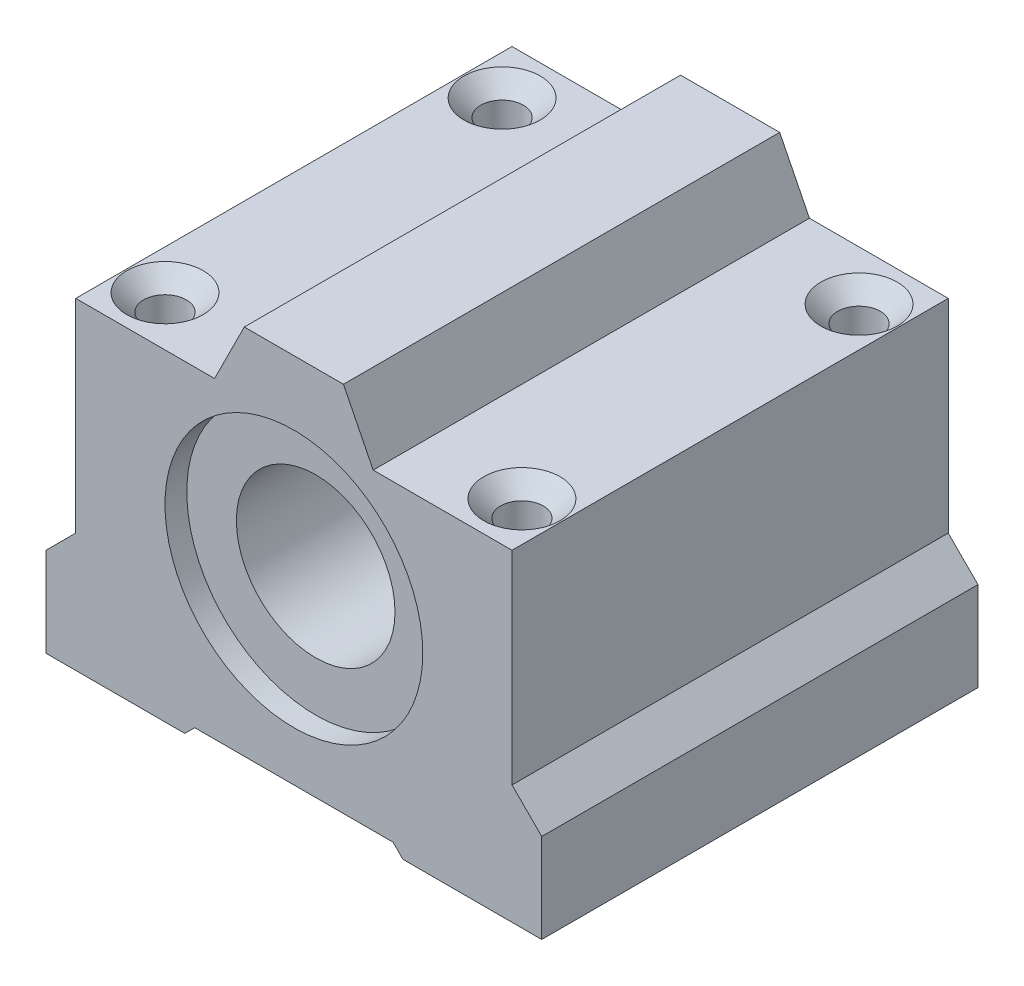
ISO-10303-21;
HEADER;
FILE_DESCRIPTION(('STEP AP214'),'2;1');
FILE_NAME('part.step','',(''),(''),'','','');
FILE_SCHEMA(('AUTOMOTIVE_DESIGN { 1 0 10303 214 1 1 1 1 }'));
ENDSEC;
DATA;
#1=APPLICATION_CONTEXT('core data for automotive mechanical design processes');
#2=APPLICATION_PROTOCOL_DEFINITION('international standard','automotive_design',2000,#1);
#3=PRODUCT_CONTEXT('',#1,'mechanical');
#4=PRODUCT('Part','Part','',(#3));
#5=PRODUCT_RELATED_PRODUCT_CATEGORY('part','',(#4));
#6=PRODUCT_DEFINITION_FORMATION('','',#4);
#7=PRODUCT_DEFINITION_CONTEXT('part definition',#1,'design');
#8=PRODUCT_DEFINITION('design','',#6,#7);
#9=PRODUCT_DEFINITION_SHAPE('','',#8);
#10=(LENGTH_UNIT() NAMED_UNIT(*) SI_UNIT(.MILLI.,.METRE.));
#11=(NAMED_UNIT(*) PLANE_ANGLE_UNIT() SI_UNIT($,.RADIAN.));
#12=(NAMED_UNIT(*) SI_UNIT($,.STERADIAN.) SOLID_ANGLE_UNIT());
#13=UNCERTAINTY_MEASURE_WITH_UNIT(LENGTH_MEASURE(1.E-05),#10,'distance_accuracy_value','');
#14=(GEOMETRIC_REPRESENTATION_CONTEXT(3) GLOBAL_UNCERTAINTY_ASSIGNED_CONTEXT((#13)) GLOBAL_UNIT_ASSIGNED_CONTEXT((#10,
#11,#12)) REPRESENTATION_CONTEXT('',''));
#15=CARTESIAN_POINT('',(0.,0.,0.));
#16=DIRECTION('',(0.,0.,1.));
#17=DIRECTION('',(1.,0.,0.));
#18=AXIS2_PLACEMENT_3D('',#15,#16,#17);
#19=CARTESIAN_POINT('',(-25.,-19.,44.));
#20=DIRECTION('',(0.,1.,0.));
#21=DIRECTION('',(-1.,0.,0.));
#22=AXIS2_PLACEMENT_3D('',#19,#20,#21);
#23=PLANE('',#22);
#24=CARTESIAN_POINT('',(-18.,-19.,39.));
#25=DIRECTION('',(0.,-1.,0.));
#26=DIRECTION('',(0.,0.,-1.));
#27=AXIS2_PLACEMENT_3D('',#24,#25,#26);
#28=CIRCLE('',#27,4.5);
#29=CARTESIAN_POINT('',(-18.,-19.,34.5));
#30=VERTEX_POINT('',#29);
#31=EDGE_CURVE('E851',#30,#30,#28,.T.);
#32=ORIENTED_EDGE('',*,*,#31,.F.);
#33=EDGE_LOOP('',(#32));
#34=FACE_BOUND('',#33,.T.);
#35=DIRECTION('',(1.,0.,0.));
#36=VECTOR('',#35,1.);
#37=CARTESIAN_POINT('',(-25.,-19.,0.));
#38=LINE('',#37,#36);
#39=CARTESIAN_POINT('',(-25.,-19.,0.));
#40=VERTEX_POINT('',#39);
#41=CARTESIAN_POINT('',(-11.,-19.,0.));
#42=VERTEX_POINT('',#41);
#43=EDGE_CURVE('E188',#40,#42,#38,.T.);
#44=ORIENTED_EDGE('',*,*,#43,.T.);
#45=DIRECTION('',(0.,0.,-1.));
#46=VECTOR('',#45,1.);
#47=CARTESIAN_POINT('',(-11.,-19.,44.));
#48=LINE('',#47,#46);
#49=CARTESIAN_POINT('',(-11.,-19.,44.));
#50=VERTEX_POINT('',#49);
#51=EDGE_CURVE('E234',#50,#42,#48,.T.);
#52=ORIENTED_EDGE('',*,*,#51,.F.);
#53=DIRECTION('',(1.,0.,0.));
#54=VECTOR('',#53,1.);
#55=CARTESIAN_POINT('',(-25.,-19.,44.));
#56=LINE('',#55,#54);
#57=CARTESIAN_POINT('',(-25.,-19.,44.));
#58=VERTEX_POINT('',#57);
#59=EDGE_CURVE('E505',#58,#50,#56,.T.);
#60=ORIENTED_EDGE('',*,*,#59,.F.);
#61=DIRECTION('',(0.,0.,-1.));
#62=VECTOR('',#61,1.);
#63=CARTESIAN_POINT('',(-25.,-19.,44.));
#64=LINE('',#63,#62);
#65=EDGE_CURVE('E237',#58,#40,#64,.T.);
#66=ORIENTED_EDGE('',*,*,#65,.T.);
#67=EDGE_LOOP('',(#44,#52,#60,#66));
#68=FACE_BOUND('',#67,.T.);
#69=CARTESIAN_POINT('',(-18.,-19.,5.));
#70=DIRECTION('',(0.,-1.,0.));
#71=DIRECTION('',(0.,0.,-1.));
#72=AXIS2_PLACEMENT_3D('',#69,#70,#71);
#73=CIRCLE('',#72,4.5);
#74=CARTESIAN_POINT('',(-18.,-19.,0.499999999999997));
#75=VERTEX_POINT('',#74);
#76=EDGE_CURVE('E275',#75,#75,#73,.T.);
#77=ORIENTED_EDGE('',*,*,#76,.F.);
#78=EDGE_LOOP('',(#77));
#79=FACE_BOUND('',#78,.T.);
#80=ADVANCED_FACE('F32',(#34,#68,#79),#23,.F.);
#81=CARTESIAN_POINT('',(11.,-19.,44.));
#82=DIRECTION('',(0.,1.,0.));
#83=DIRECTION('',(-1.,0.,0.));
#84=AXIS2_PLACEMENT_3D('',#81,#82,#83);
#85=PLANE('',#84);
#86=CARTESIAN_POINT('',(18.,-19.,39.));
#87=DIRECTION('',(0.,-1.,0.));
#88=DIRECTION('',(0.,0.,-1.));
#89=AXIS2_PLACEMENT_3D('',#86,#87,#88);
#90=CIRCLE('',#89,4.5);
#91=CARTESIAN_POINT('',(18.,-19.,34.5));
#92=VERTEX_POINT('',#91);
#93=EDGE_CURVE('E265',#92,#92,#90,.T.);
#94=ORIENTED_EDGE('',*,*,#93,.F.);
#95=EDGE_LOOP('',(#94));
#96=FACE_BOUND('',#95,.T.);
#97=DIRECTION('',(1.,0.,0.));
#98=VECTOR('',#97,1.);
#99=CARTESIAN_POINT('',(11.,-19.,0.));
#100=LINE('',#99,#98);
#101=CARTESIAN_POINT('',(11.,-19.,0.));
#102=VERTEX_POINT('',#101);
#103=CARTESIAN_POINT('',(25.,-19.,0.));
#104=VERTEX_POINT('',#103);
#105=EDGE_CURVE('E196',#102,#104,#100,.T.);
#106=ORIENTED_EDGE('',*,*,#105,.T.);
#107=DIRECTION('',(0.,0.,-1.));
#108=VECTOR('',#107,1.);
#109=CARTESIAN_POINT('',(25.,-19.,44.));
#110=LINE('',#109,#108);
#111=CARTESIAN_POINT('',(25.,-19.,44.));
#112=VERTEX_POINT('',#111);
#113=EDGE_CURVE('E222',#112,#104,#110,.T.);
#114=ORIENTED_EDGE('',*,*,#113,.F.);
#115=DIRECTION('',(1.,0.,0.));
#116=VECTOR('',#115,1.);
#117=CARTESIAN_POINT('',(11.,-19.,44.));
#118=LINE('',#117,#116);
#119=CARTESIAN_POINT('',(11.,-19.,44.));
#120=VERTEX_POINT('',#119);
#121=EDGE_CURVE('E479',#120,#112,#118,.T.);
#122=ORIENTED_EDGE('',*,*,#121,.F.);
#123=DIRECTION('',(0.,0.,-1.));
#124=VECTOR('',#123,1.);
#125=CARTESIAN_POINT('',(11.,-19.,44.));
#126=LINE('',#125,#124);
#127=EDGE_CURVE('E225',#120,#102,#126,.T.);
#128=ORIENTED_EDGE('',*,*,#127,.T.);
#129=EDGE_LOOP('',(#106,#114,#122,#128));
#130=FACE_BOUND('',#129,.T.);
#131=CARTESIAN_POINT('',(18.,-19.,5.));
#132=DIRECTION('',(0.,-1.,0.));
#133=DIRECTION('',(0.,0.,-1.));
#134=AXIS2_PLACEMENT_3D('',#131,#132,#133);
#135=CIRCLE('',#134,4.5);
#136=CARTESIAN_POINT('',(18.,-19.,0.5));
#137=VERTEX_POINT('',#136);
#138=EDGE_CURVE('E270',#137,#137,#135,.T.);
#139=ORIENTED_EDGE('',*,*,#138,.F.);
#140=EDGE_LOOP('',(#139));
#141=FACE_BOUND('',#140,.T.);
#142=ADVANCED_FACE('F331',(#96,#130,#141),#85,.F.);
#143=CARTESIAN_POINT('',(0.,0.,44.));
#144=DIRECTION('',(0.,0.,-1.));
#145=DIRECTION('',(-1.,0.,0.));
#146=AXIS2_PLACEMENT_3D('',#143,#144,#145);
#147=CYLINDRICAL_SURFACE('',#146,8.);
#148=CARTESIAN_POINT('',(0.,0.,41.8));
#149=DIRECTION('',(0.,0.,1.));
#150=DIRECTION('',(1.,0.,0.));
#151=AXIS2_PLACEMENT_3D('',#148,#149,#150);
#152=CIRCLE('',#151,8.);
#153=CARTESIAN_POINT('',(8.,0.,41.8));
#154=VERTEX_POINT('',#153);
#155=EDGE_CURVE('E182',#154,#154,#152,.T.);
#156=ORIENTED_EDGE('',*,*,#155,.T.);
#157=EDGE_LOOP('',(#156));
#158=FACE_BOUND('',#157,.T.);
#159=CARTESIAN_POINT('',(0.,0.,2.2));
#160=DIRECTION('',(0.,0.,-1.));
#161=DIRECTION('',(-1.,0.,0.));
#162=AXIS2_PLACEMENT_3D('',#159,#160,#161);
#163=CIRCLE('',#162,8.);
#164=CARTESIAN_POINT('',(-8.,0.,2.2));
#165=VERTEX_POINT('',#164);
#166=EDGE_CURVE('E252',#165,#165,#163,.T.);
#167=ORIENTED_EDGE('',*,*,#166,.T.);
#168=EDGE_LOOP('',(#167));
#169=FACE_BOUND('',#168,.T.);
#170=ADVANCED_FACE('F337',(#158,#169),#147,.F.);
#171=CARTESIAN_POINT('',(-22.,13.5,44.));
#172=DIRECTION('',(0.,0.,1.));
#173=DIRECTION('',(1.,0.,0.));
#174=AXIS2_PLACEMENT_3D('',#171,#172,#173);
#175=PLANE('',#174);
#176=CARTESIAN_POINT('',(0.,0.,44.));
#177=DIRECTION('',(0.,0.,1.));
#178=DIRECTION('',(1.,0.,0.));
#179=AXIS2_PLACEMENT_3D('',#176,#177,#178);
#180=CIRCLE('',#179,13.);
#181=CARTESIAN_POINT('',(13.,0.,44.));
#182=VERTEX_POINT('',#181);
#183=EDGE_CURVE('E255',#182,#182,#180,.T.);
#184=ORIENTED_EDGE('',*,*,#183,.F.);
#185=EDGE_LOOP('',(#184));
#186=FACE_BOUND('',#185,.T.);
#187=DIRECTION('',(-1.,0.,0.));
#188=VECTOR('',#187,1.);
#189=CARTESIAN_POINT('',(-8.,13.5,44.));
#190=LINE('',#189,#188);
#191=CARTESIAN_POINT('',(-8.,13.5,44.));
#192=VERTEX_POINT('',#191);
#193=CARTESIAN_POINT('',(-22.,13.5,44.));
#194=VERTEX_POINT('',#193);
#195=EDGE_CURVE('E209',#192,#194,#190,.T.);
#196=ORIENTED_EDGE('',*,*,#195,.T.);
#197=DIRECTION('',(0.,-1.,0.));
#198=VECTOR('',#197,1.);
#199=CARTESIAN_POINT('',(-22.,13.5,44.));
#200=LINE('',#199,#198);
#201=CARTESIAN_POINT('',(-22.,-7.,44.));
#202=VERTEX_POINT('',#201);
#203=EDGE_CURVE('E117',#194,#202,#200,.T.);
#204=ORIENTED_EDGE('',*,*,#203,.T.);
#205=DIRECTION('',(-0.707106781186547,-0.707106781186548,0.));
#206=VECTOR('',#205,1.);
#207=CARTESIAN_POINT('',(-22.,-7.,44.));
#208=LINE('',#207,#206);
#209=CARTESIAN_POINT('',(-25.,-10.,44.));
#210=VERTEX_POINT('',#209);
#211=EDGE_CURVE('E497',#202,#210,#208,.T.);
#212=ORIENTED_EDGE('',*,*,#211,.T.);
#213=DIRECTION('',(0.,-1.,0.));
#214=VECTOR('',#213,1.);
#215=CARTESIAN_POINT('',(-25.,-10.,44.));
#216=LINE('',#215,#214);
#217=EDGE_CURVE('E503',#210,#58,#216,.T.);
#218=ORIENTED_EDGE('',*,*,#217,.T.);
#219=ORIENTED_EDGE('',*,*,#59,.T.);
#220=DIRECTION('',(0.707106781186546,0.707106781186549,0.));
#221=VECTOR('',#220,1.);
#222=CARTESIAN_POINT('',(-11.,-19.,44.));
#223=LINE('',#222,#221);
#224=CARTESIAN_POINT('',(-10.,-18.,44.));
#225=VERTEX_POINT('',#224);
#226=EDGE_CURVE('E507',#50,#225,#223,.T.);
#227=ORIENTED_EDGE('',*,*,#226,.T.);
#228=DIRECTION('',(1.,0.,0.));
#229=VECTOR('',#228,1.);
#230=CARTESIAN_POINT('',(-10.,-18.,44.));
#231=LINE('',#230,#229);
#232=CARTESIAN_POINT('',(10.,-18.,44.));
#233=VERTEX_POINT('',#232);
#234=EDGE_CURVE('E509',#225,#233,#231,.T.);
#235=ORIENTED_EDGE('',*,*,#234,.T.);
#236=DIRECTION('',(0.707106781186547,-0.707106781186548,0.));
#237=VECTOR('',#236,1.);
#238=CARTESIAN_POINT('',(10.,-18.,44.));
#239=LINE('',#238,#237);
#240=EDGE_CURVE('E465',#233,#120,#239,.T.);
#241=ORIENTED_EDGE('',*,*,#240,.T.);
#242=ORIENTED_EDGE('',*,*,#121,.T.);
#243=DIRECTION('',(0.,1.,0.));
#244=VECTOR('',#243,1.);
#245=CARTESIAN_POINT('',(25.,-19.,44.));
#246=LINE('',#245,#244);
#247=CARTESIAN_POINT('',(25.,-10.,44.));
#248=VERTEX_POINT('',#247);
#249=EDGE_CURVE('E476',#112,#248,#246,.T.);
#250=ORIENTED_EDGE('',*,*,#249,.T.);
#251=DIRECTION('',(-0.70710678118655,0.707106781186545,0.));
#252=VECTOR('',#251,1.);
#253=CARTESIAN_POINT('',(25.,-10.,44.));
#254=LINE('',#253,#252);
#255=CARTESIAN_POINT('',(22.,-7.,44.));
#256=VERTEX_POINT('',#255);
#257=EDGE_CURVE('E478',#248,#256,#254,.T.);
#258=ORIENTED_EDGE('',*,*,#257,.T.);
#259=DIRECTION('',(0.,1.,0.));
#260=VECTOR('',#259,1.);
#261=CARTESIAN_POINT('',(22.,-7.,44.));
#262=LINE('',#261,#260);
#263=CARTESIAN_POINT('',(22.,13.5,44.));
#264=VERTEX_POINT('',#263);
#265=EDGE_CURVE('E481',#256,#264,#262,.T.);
#266=ORIENTED_EDGE('',*,*,#265,.T.);
#267=DIRECTION('',(-1.,0.,0.));
#268=VECTOR('',#267,1.);
#269=CARTESIAN_POINT('',(22.,13.5,44.));
#270=LINE('',#269,#268);
#271=CARTESIAN_POINT('',(8.,13.5,44.));
#272=VERTEX_POINT('',#271);
#273=EDGE_CURVE('E160',#264,#272,#270,.T.);
#274=ORIENTED_EDGE('',*,*,#273,.T.);
#275=DIRECTION('',(-0.447213595499958,0.894427190999916,0.));
#276=VECTOR('',#275,1.);
#277=CARTESIAN_POINT('',(8.,13.5,44.));
#278=LINE('',#277,#276);
#279=CARTESIAN_POINT('',(5.,19.5,44.));
#280=VERTEX_POINT('',#279);
#281=EDGE_CURVE('E154',#272,#280,#278,.T.);
#282=ORIENTED_EDGE('',*,*,#281,.T.);
#283=DIRECTION('',(-1.,0.,0.));
#284=VECTOR('',#283,1.);
#285=CARTESIAN_POINT('',(5.,19.5,44.));
#286=LINE('',#285,#284);
#287=CARTESIAN_POINT('',(-5.,19.5,44.));
#288=VERTEX_POINT('',#287);
#289=EDGE_CURVE('E158',#280,#288,#286,.T.);
#290=ORIENTED_EDGE('',*,*,#289,.T.);
#291=DIRECTION('',(-0.447213595499958,-0.894427190999916,0.));
#292=VECTOR('',#291,1.);
#293=CARTESIAN_POINT('',(-5.,19.5,44.));
#294=LINE('',#293,#292);
#295=EDGE_CURVE('E49',#288,#192,#294,.T.);
#296=ORIENTED_EDGE('',*,*,#295,.T.);
#297=EDGE_LOOP('',(#196,#204,#212,#218,#219,#227,#235,#241,#242,#250,#258,#266,#274,#282,#290,#296));
#298=FACE_BOUND('',#297,.T.);
#299=ADVANCED_FACE('F156',(#186,#298),#175,.T.);
#300=CARTESIAN_POINT('',(-22.,13.5,0.));
#301=DIRECTION('',(0.,0.,1.));
#302=DIRECTION('',(1.,0.,0.));
#303=AXIS2_PLACEMENT_3D('',#300,#301,#302);
#304=PLANE('',#303);
#305=CARTESIAN_POINT('',(0.,0.,0.));
#306=DIRECTION('',(0.,0.,-1.));
#307=DIRECTION('',(-1.,0.,0.));
#308=AXIS2_PLACEMENT_3D('',#305,#306,#307);
#309=CIRCLE('',#308,13.);
#310=CARTESIAN_POINT('',(-13.,0.,0.));
#311=VERTEX_POINT('',#310);
#312=EDGE_CURVE('E260',#311,#311,#309,.T.);
#313=ORIENTED_EDGE('',*,*,#312,.F.);
#314=EDGE_LOOP('',(#313));
#315=FACE_BOUND('',#314,.T.);
#316=DIRECTION('',(-1.,0.,0.));
#317=VECTOR('',#316,1.);
#318=CARTESIAN_POINT('',(-8.,13.5,0.));
#319=LINE('',#318,#317);
#320=CARTESIAN_POINT('',(-8.,13.5,0.));
#321=VERTEX_POINT('',#320);
#322=CARTESIAN_POINT('',(-22.,13.5,0.));
#323=VERTEX_POINT('',#322);
#324=EDGE_CURVE('E178',#321,#323,#319,.T.);
#325=ORIENTED_EDGE('',*,*,#324,.F.);
#326=DIRECTION('',(-0.447213595499958,-0.894427190999916,0.));
#327=VECTOR('',#326,1.);
#328=CARTESIAN_POINT('',(-5.,19.5,0.));
#329=LINE('',#328,#327);
#330=CARTESIAN_POINT('',(-5.,19.5,0.));
#331=VERTEX_POINT('',#330);
#332=EDGE_CURVE('E108',#331,#321,#329,.T.);
#333=ORIENTED_EDGE('',*,*,#332,.F.);
#334=DIRECTION('',(-1.,0.,0.));
#335=VECTOR('',#334,1.);
#336=CARTESIAN_POINT('',(5.,19.5,0.));
#337=LINE('',#336,#335);
#338=CARTESIAN_POINT('',(5.,19.5,0.));
#339=VERTEX_POINT('',#338);
#340=EDGE_CURVE('E102',#339,#331,#337,.T.);
#341=ORIENTED_EDGE('',*,*,#340,.F.);
#342=DIRECTION('',(-0.447213595499958,0.894427190999916,0.));
#343=VECTOR('',#342,1.);
#344=CARTESIAN_POINT('',(8.,13.5,0.));
#345=LINE('',#344,#343);
#346=CARTESIAN_POINT('',(8.,13.5,0.));
#347=VERTEX_POINT('',#346);
#348=EDGE_CURVE('E168',#347,#339,#345,.T.);
#349=ORIENTED_EDGE('',*,*,#348,.F.);
#350=DIRECTION('',(-1.,0.,0.));
#351=VECTOR('',#350,1.);
#352=CARTESIAN_POINT('',(22.,13.5,0.));
#353=LINE('',#352,#351);
#354=CARTESIAN_POINT('',(22.,13.5,0.));
#355=VERTEX_POINT('',#354);
#356=EDGE_CURVE('E204',#355,#347,#353,.T.);
#357=ORIENTED_EDGE('',*,*,#356,.F.);
#358=DIRECTION('',(0.,1.,0.));
#359=VECTOR('',#358,1.);
#360=CARTESIAN_POINT('',(22.,-7.,0.));
#361=LINE('',#360,#359);
#362=CARTESIAN_POINT('',(22.,-7.,0.));
#363=VERTEX_POINT('',#362);
#364=EDGE_CURVE('E202',#363,#355,#361,.T.);
#365=ORIENTED_EDGE('',*,*,#364,.F.);
#366=DIRECTION('',(-0.70710678118655,0.707106781186545,0.));
#367=VECTOR('',#366,1.);
#368=CARTESIAN_POINT('',(25.,-10.,0.));
#369=LINE('',#368,#367);
#370=CARTESIAN_POINT('',(25.,-10.,0.));
#371=VERTEX_POINT('',#370);
#372=EDGE_CURVE('E200',#371,#363,#369,.T.);
#373=ORIENTED_EDGE('',*,*,#372,.F.);
#374=DIRECTION('',(0.,1.,0.));
#375=VECTOR('',#374,1.);
#376=CARTESIAN_POINT('',(25.,-19.,0.));
#377=LINE('',#376,#375);
#378=EDGE_CURVE('E198',#104,#371,#377,.T.);
#379=ORIENTED_EDGE('',*,*,#378,.F.);
#380=ORIENTED_EDGE('',*,*,#105,.F.);
#381=DIRECTION('',(0.707106781186547,-0.707106781186548,0.));
#382=VECTOR('',#381,1.);
#383=CARTESIAN_POINT('',(10.,-18.,0.));
#384=LINE('',#383,#382);
#385=CARTESIAN_POINT('',(10.,-18.,0.));
#386=VERTEX_POINT('',#385);
#387=EDGE_CURVE('E194',#386,#102,#384,.T.);
#388=ORIENTED_EDGE('',*,*,#387,.F.);
#389=DIRECTION('',(1.,0.,0.));
#390=VECTOR('',#389,1.);
#391=CARTESIAN_POINT('',(-10.,-18.,0.));
#392=LINE('',#391,#390);
#393=CARTESIAN_POINT('',(-10.,-18.,0.));
#394=VERTEX_POINT('',#393);
#395=EDGE_CURVE('E192',#394,#386,#392,.T.);
#396=ORIENTED_EDGE('',*,*,#395,.F.);
#397=DIRECTION('',(0.707106781186546,0.707106781186549,0.));
#398=VECTOR('',#397,1.);
#399=CARTESIAN_POINT('',(-11.,-19.,0.));
#400=LINE('',#399,#398);
#401=EDGE_CURVE('E190',#42,#394,#400,.T.);
#402=ORIENTED_EDGE('',*,*,#401,.F.);
#403=ORIENTED_EDGE('',*,*,#43,.F.);
#404=DIRECTION('',(0.,-1.,0.));
#405=VECTOR('',#404,1.);
#406=CARTESIAN_POINT('',(-25.,-10.,0.));
#407=LINE('',#406,#405);
#408=CARTESIAN_POINT('',(-25.,-10.,0.));
#409=VERTEX_POINT('',#408);
#410=EDGE_CURVE('E186',#409,#40,#407,.T.);
#411=ORIENTED_EDGE('',*,*,#410,.F.);
#412=DIRECTION('',(-0.707106781186547,-0.707106781186548,0.));
#413=VECTOR('',#412,1.);
#414=CARTESIAN_POINT('',(-22.,-7.,0.));
#415=LINE('',#414,#413);
#416=CARTESIAN_POINT('',(-22.,-7.,0.));
#417=VERTEX_POINT('',#416);
#418=EDGE_CURVE('E184',#417,#409,#415,.T.);
#419=ORIENTED_EDGE('',*,*,#418,.F.);
#420=DIRECTION('',(0.,-1.,0.));
#421=VECTOR('',#420,1.);
#422=CARTESIAN_POINT('',(-22.,13.5,0.));
#423=LINE('',#422,#421);
#424=EDGE_CURVE('E181',#323,#417,#423,.T.);
#425=ORIENTED_EDGE('',*,*,#424,.F.);
#426=EDGE_LOOP('',(#325,#333,#341,#349,#357,#365,#373,#379,#380,#388,#396,#402,#403,#411,#419,#425));
#427=FACE_BOUND('',#426,.T.);
#428=ADVANCED_FACE('F359',(#315,#427),#304,.F.);
#429=CARTESIAN_POINT('',(-8.,13.5,44.));
#430=DIRECTION('',(0.,-1.,0.));
#431=DIRECTION('',(1.,0.,0.));
#432=AXIS2_PLACEMENT_3D('',#429,#430,#431);
#433=PLANE('',#432);
#434=CARTESIAN_POINT('',(-18.,13.5,39.));
#435=DIRECTION('',(0.,-1.,0.));
#436=DIRECTION('',(1.,0.,0.));
#437=AXIS2_PLACEMENT_3D('',#434,#435,#436);
#438=CIRCLE('',#437,3.85);
#439=CARTESIAN_POINT('',(-14.15,13.5,39.));
#440=VERTEX_POINT('',#439);
#441=EDGE_CURVE('E41',#440,#440,#438,.T.);
#442=ORIENTED_EDGE('',*,*,#441,.T.);
#443=EDGE_LOOP('',(#442));
#444=FACE_BOUND('',#443,.T.);
#445=CARTESIAN_POINT('',(-18.,13.5,5.));
#446=DIRECTION('',(0.,-1.,0.));
#447=DIRECTION('',(1.,0.,0.));
#448=AXIS2_PLACEMENT_3D('',#445,#446,#447);
#449=CIRCLE('',#448,3.85);
#450=CARTESIAN_POINT('',(-14.15,13.5,5.));
#451=VERTEX_POINT('',#450);
#452=EDGE_CURVE('E291',#451,#451,#449,.T.);
#453=ORIENTED_EDGE('',*,*,#452,.T.);
#454=EDGE_LOOP('',(#453));
#455=FACE_BOUND('',#454,.T.);
#456=ORIENTED_EDGE('',*,*,#324,.T.);
#457=DIRECTION('',(0.,0.,-1.));
#458=VECTOR('',#457,1.);
#459=CARTESIAN_POINT('',(-22.,13.5,44.));
#460=LINE('',#459,#458);
#461=EDGE_CURVE('E246',#194,#323,#460,.T.);
#462=ORIENTED_EDGE('',*,*,#461,.F.);
#463=ORIENTED_EDGE('',*,*,#195,.F.);
#464=DIRECTION('',(0.,0.,-1.));
#465=VECTOR('',#464,1.);
#466=CARTESIAN_POINT('',(-8.,13.5,44.));
#467=LINE('',#466,#465);
#468=EDGE_CURVE('E174',#192,#321,#467,.T.);
#469=ORIENTED_EDGE('',*,*,#468,.T.);
#470=EDGE_LOOP('',(#456,#462,#463,#469));
#471=FACE_BOUND('',#470,.T.);
#472=ADVANCED_FACE('F296',(#444,#455,#471),#433,.F.);
#473=CARTESIAN_POINT('',(-22.,13.5,44.));
#474=DIRECTION('',(1.,0.,0.));
#475=DIRECTION('',(0.,0.,-1.));
#476=AXIS2_PLACEMENT_3D('',#473,#474,#475);
#477=PLANE('',#476);
#478=ORIENTED_EDGE('',*,*,#424,.T.);
#479=DIRECTION('',(0.,0.,-1.));
#480=VECTOR('',#479,1.);
#481=CARTESIAN_POINT('',(-22.,-7.,44.));
#482=LINE('',#481,#480);
#483=EDGE_CURVE('E243',#202,#417,#482,.T.);
#484=ORIENTED_EDGE('',*,*,#483,.F.);
#485=ORIENTED_EDGE('',*,*,#203,.F.);
#486=ORIENTED_EDGE('',*,*,#461,.T.);
#487=EDGE_LOOP('',(#478,#484,#485,#486));
#488=FACE_BOUND('',#487,.T.);
#489=ADVANCED_FACE('F353',(#488),#477,.F.);
#490=CARTESIAN_POINT('',(-22.,-7.,44.));
#491=DIRECTION('',(0.707106781186548,-0.707106781186547,0.));
#492=DIRECTION('',(0.707106781186547,0.707106781186548,0.));
#493=AXIS2_PLACEMENT_3D('',#490,#491,#492);
#494=PLANE('',#493);
#495=ORIENTED_EDGE('',*,*,#418,.T.);
#496=DIRECTION('',(0.,0.,-1.));
#497=VECTOR('',#496,1.);
#498=CARTESIAN_POINT('',(-25.,-10.,44.));
#499=LINE('',#498,#497);
#500=EDGE_CURVE('E240',#210,#409,#499,.T.);
#501=ORIENTED_EDGE('',*,*,#500,.F.);
#502=ORIENTED_EDGE('',*,*,#211,.F.);
#503=ORIENTED_EDGE('',*,*,#483,.T.);
#504=EDGE_LOOP('',(#495,#501,#502,#503));
#505=FACE_BOUND('',#504,.T.);
#506=ADVANCED_FACE('F349',(#505),#494,.F.);
#507=CARTESIAN_POINT('',(-25.,-10.,44.));
#508=DIRECTION('',(1.,0.,0.));
#509=DIRECTION('',(0.,0.,-1.));
#510=AXIS2_PLACEMENT_3D('',#507,#508,#509);
#511=PLANE('',#510);
#512=ORIENTED_EDGE('',*,*,#410,.T.);
#513=ORIENTED_EDGE('',*,*,#65,.F.);
#514=ORIENTED_EDGE('',*,*,#217,.F.);
#515=ORIENTED_EDGE('',*,*,#500,.T.);
#516=EDGE_LOOP('',(#512,#513,#514,#515));
#517=FACE_BOUND('',#516,.T.);
#518=ADVANCED_FACE('F346',(#517),#511,.F.);
#519=CARTESIAN_POINT('',(-11.,-19.,44.));
#520=DIRECTION('',(-0.707106781186549,0.707106781186546,0.));
#521=DIRECTION('',(-0.707106781186546,-0.707106781186549,0.));
#522=AXIS2_PLACEMENT_3D('',#519,#520,#521);
#523=PLANE('',#522);
#524=ORIENTED_EDGE('',*,*,#401,.T.);
#525=DIRECTION('',(0.,0.,-1.));
#526=VECTOR('',#525,1.);
#527=CARTESIAN_POINT('',(-10.,-18.,44.));
#528=LINE('',#527,#526);
#529=EDGE_CURVE('E231',#225,#394,#528,.T.);
#530=ORIENTED_EDGE('',*,*,#529,.F.);
#531=ORIENTED_EDGE('',*,*,#226,.F.);
#532=ORIENTED_EDGE('',*,*,#51,.T.);
#533=EDGE_LOOP('',(#524,#530,#531,#532));
#534=FACE_BOUND('',#533,.T.);
#535=ADVANCED_FACE('F344',(#534),#523,.F.);
#536=CARTESIAN_POINT('',(-10.,-18.,44.));
#537=DIRECTION('',(0.,1.,0.));
#538=DIRECTION('',(0.,0.,1.));
#539=AXIS2_PLACEMENT_3D('',#536,#537,#538);
#540=PLANE('',#539);
#541=ORIENTED_EDGE('',*,*,#395,.T.);
#542=DIRECTION('',(0.,0.,-1.));
#543=VECTOR('',#542,1.);
#544=CARTESIAN_POINT('',(10.,-18.,44.));
#545=LINE('',#544,#543);
#546=EDGE_CURVE('E228',#233,#386,#545,.T.);
#547=ORIENTED_EDGE('',*,*,#546,.F.);
#548=ORIENTED_EDGE('',*,*,#234,.F.);
#549=ORIENTED_EDGE('',*,*,#529,.T.);
#550=EDGE_LOOP('',(#541,#547,#548,#549));
#551=FACE_BOUND('',#550,.T.);
#552=ADVANCED_FACE('F448',(#551),#540,.F.);
#553=CARTESIAN_POINT('',(10.,-18.,44.));
#554=DIRECTION('',(0.707106781186548,0.707106781186547,0.));
#555=DIRECTION('',(-0.707106781186547,0.707106781186548,0.));
#556=AXIS2_PLACEMENT_3D('',#553,#554,#555);
#557=PLANE('',#556);
#558=ORIENTED_EDGE('',*,*,#387,.T.);
#559=ORIENTED_EDGE('',*,*,#127,.F.);
#560=ORIENTED_EDGE('',*,*,#240,.F.);
#561=ORIENTED_EDGE('',*,*,#546,.T.);
#562=EDGE_LOOP('',(#558,#559,#560,#561));
#563=FACE_BOUND('',#562,.T.);
#564=ADVANCED_FACE('F444',(#563),#557,.F.);
#565=CARTESIAN_POINT('',(25.,-19.,44.));
#566=DIRECTION('',(-1.,0.,0.));
#567=DIRECTION('',(0.,0.,1.));
#568=AXIS2_PLACEMENT_3D('',#565,#566,#567);
#569=PLANE('',#568);
#570=ORIENTED_EDGE('',*,*,#378,.T.);
#571=DIRECTION('',(0.,0.,-1.));
#572=VECTOR('',#571,1.);
#573=CARTESIAN_POINT('',(25.,-10.,44.));
#574=LINE('',#573,#572);
#575=EDGE_CURVE('E219',#248,#371,#574,.T.);
#576=ORIENTED_EDGE('',*,*,#575,.F.);
#577=ORIENTED_EDGE('',*,*,#249,.F.);
#578=ORIENTED_EDGE('',*,*,#113,.T.);
#579=EDGE_LOOP('',(#570,#576,#577,#578));
#580=FACE_BOUND('',#579,.T.);
#581=ADVANCED_FACE('F441',(#580),#569,.F.);
#582=CARTESIAN_POINT('',(25.,-10.,44.));
#583=DIRECTION('',(-0.707106781186545,-0.70710678118655,0.));
#584=DIRECTION('',(0.70710678118655,-0.707106781186545,0.));
#585=AXIS2_PLACEMENT_3D('',#582,#583,#584);
#586=PLANE('',#585);
#587=ORIENTED_EDGE('',*,*,#372,.T.);
#588=DIRECTION('',(0.,0.,-1.));
#589=VECTOR('',#588,1.);
#590=CARTESIAN_POINT('',(22.,-7.,44.));
#591=LINE('',#590,#589);
#592=EDGE_CURVE('E216',#256,#363,#591,.T.);
#593=ORIENTED_EDGE('',*,*,#592,.F.);
#594=ORIENTED_EDGE('',*,*,#257,.F.);
#595=ORIENTED_EDGE('',*,*,#575,.T.);
#596=EDGE_LOOP('',(#587,#593,#594,#595));
#597=FACE_BOUND('',#596,.T.);
#598=ADVANCED_FACE('F437',(#597),#586,.F.);
#599=CARTESIAN_POINT('',(22.,-7.,44.));
#600=DIRECTION('',(-1.,0.,0.));
#601=DIRECTION('',(0.,0.,1.));
#602=AXIS2_PLACEMENT_3D('',#599,#600,#601);
#603=PLANE('',#602);
#604=ORIENTED_EDGE('',*,*,#364,.T.);
#605=DIRECTION('',(0.,0.,-1.));
#606=VECTOR('',#605,1.);
#607=CARTESIAN_POINT('',(22.,13.5,44.));
#608=LINE('',#607,#606);
#609=EDGE_CURVE('E213',#264,#355,#608,.T.);
#610=ORIENTED_EDGE('',*,*,#609,.F.);
#611=ORIENTED_EDGE('',*,*,#265,.F.);
#612=ORIENTED_EDGE('',*,*,#592,.T.);
#613=EDGE_LOOP('',(#604,#610,#611,#612));
#614=FACE_BOUND('',#613,.T.);
#615=ADVANCED_FACE('F433',(#614),#603,.F.);
#616=CARTESIAN_POINT('',(22.,13.5,44.));
#617=DIRECTION('',(0.,-1.,0.));
#618=DIRECTION('',(1.,0.,0.));
#619=AXIS2_PLACEMENT_3D('',#616,#617,#618);
#620=PLANE('',#619);
#621=CARTESIAN_POINT('',(18.,13.5,5.));
#622=DIRECTION('',(0.,-1.,0.));
#623=DIRECTION('',(1.,0.,0.));
#624=AXIS2_PLACEMENT_3D('',#621,#622,#623);
#625=CIRCLE('',#624,3.85000000000001);
#626=CARTESIAN_POINT('',(21.85,13.5,5.));
#627=VERTEX_POINT('',#626);
#628=EDGE_CURVE('E282',#627,#627,#625,.T.);
#629=ORIENTED_EDGE('',*,*,#628,.T.);
#630=EDGE_LOOP('',(#629));
#631=FACE_BOUND('',#630,.T.);
#632=CARTESIAN_POINT('',(18.,13.5,39.));
#633=DIRECTION('',(0.,-1.,0.));
#634=DIRECTION('',(1.,0.,0.));
#635=AXIS2_PLACEMENT_3D('',#632,#633,#634);
#636=CIRCLE('',#635,3.85000000000001);
#637=CARTESIAN_POINT('',(21.85,13.5,39.));
#638=VERTEX_POINT('',#637);
#639=EDGE_CURVE('E279',#638,#638,#636,.T.);
#640=ORIENTED_EDGE('',*,*,#639,.T.);
#641=EDGE_LOOP('',(#640));
#642=FACE_BOUND('',#641,.T.);
#643=ORIENTED_EDGE('',*,*,#356,.T.);
#644=DIRECTION('',(0.,0.,-1.));
#645=VECTOR('',#644,1.);
#646=CARTESIAN_POINT('',(8.,13.5,44.));
#647=LINE('',#646,#645);
#648=EDGE_CURVE('E169',#272,#347,#647,.T.);
#649=ORIENTED_EDGE('',*,*,#648,.F.);
#650=ORIENTED_EDGE('',*,*,#273,.F.);
#651=ORIENTED_EDGE('',*,*,#609,.T.);
#652=EDGE_LOOP('',(#643,#649,#650,#651));
#653=FACE_BOUND('',#652,.T.);
#654=ADVANCED_FACE('F430',(#631,#642,#653),#620,.F.);
#655=CARTESIAN_POINT('',(8.,13.5,44.));
#656=DIRECTION('',(-0.894427190999916,-0.447213595499958,0.));
#657=DIRECTION('',(0.447213595499958,-0.894427190999916,0.));
#658=AXIS2_PLACEMENT_3D('',#655,#656,#657);
#659=PLANE('',#658);
#660=ORIENTED_EDGE('',*,*,#348,.T.);
#661=DIRECTION('',(0.,0.,-1.));
#662=VECTOR('',#661,1.);
#663=CARTESIAN_POINT('',(5.,19.5,44.));
#664=LINE('',#663,#662);
#665=EDGE_CURVE('E165',#280,#339,#664,.T.);
#666=ORIENTED_EDGE('',*,*,#665,.F.);
#667=ORIENTED_EDGE('',*,*,#281,.F.);
#668=ORIENTED_EDGE('',*,*,#648,.T.);
#669=EDGE_LOOP('',(#660,#666,#667,#668));
#670=FACE_BOUND('',#669,.T.);
#671=ADVANCED_FACE('F166',(#670),#659,.F.);
#672=CARTESIAN_POINT('',(5.,19.5,44.));
#673=DIRECTION('',(0.,-1.,0.));
#674=DIRECTION('',(0.,0.,-1.));
#675=AXIS2_PLACEMENT_3D('',#672,#673,#674);
#676=PLANE('',#675);
#677=ORIENTED_EDGE('',*,*,#340,.T.);
#678=DIRECTION('',(0.,0.,-1.));
#679=VECTOR('',#678,1.);
#680=CARTESIAN_POINT('',(-5.,19.5,44.));
#681=LINE('',#680,#679);
#682=EDGE_CURVE('E170',#288,#331,#681,.T.);
#683=ORIENTED_EDGE('',*,*,#682,.F.);
#684=ORIENTED_EDGE('',*,*,#289,.F.);
#685=ORIENTED_EDGE('',*,*,#665,.T.);
#686=EDGE_LOOP('',(#677,#683,#684,#685));
#687=FACE_BOUND('',#686,.T.);
#688=ADVANCED_FACE('F172',(#687),#676,.F.);
#689=CARTESIAN_POINT('',(-5.,19.5,44.));
#690=DIRECTION('',(0.894427190999916,-0.447213595499958,0.));
#691=DIRECTION('',(0.447213595499958,0.894427190999916,0.));
#692=AXIS2_PLACEMENT_3D('',#689,#690,#691);
#693=PLANE('',#692);
#694=ORIENTED_EDGE('',*,*,#332,.T.);
#695=ORIENTED_EDGE('',*,*,#468,.F.);
#696=ORIENTED_EDGE('',*,*,#295,.F.);
#697=ORIENTED_EDGE('',*,*,#682,.T.);
#698=EDGE_LOOP('',(#694,#695,#696,#697));
#699=FACE_BOUND('',#698,.T.);
#700=ADVANCED_FACE('F413',(#699),#693,.F.);
#701=CARTESIAN_POINT('',(0.,0.,41.8));
#702=DIRECTION('',(0.,0.,1.));
#703=DIRECTION('',(1.,0.,0.));
#704=AXIS2_PLACEMENT_3D('',#701,#702,#703);
#705=CYLINDRICAL_SURFACE('',#704,13.);
#706=CARTESIAN_POINT('',(0.,0.,41.8));
#707=DIRECTION('',(0.,0.,1.));
#708=DIRECTION('',(1.,0.,0.));
#709=AXIS2_PLACEMENT_3D('',#706,#707,#708);
#710=CIRCLE('',#709,13.);
#711=CARTESIAN_POINT('',(13.,0.,41.8));
#712=VERTEX_POINT('',#711);
#713=EDGE_CURVE('E251',#712,#712,#710,.T.);
#714=ORIENTED_EDGE('',*,*,#713,.F.);
#715=EDGE_LOOP('',(#714));
#716=FACE_BOUND('',#715,.T.);
#717=ORIENTED_EDGE('',*,*,#183,.T.);
#718=EDGE_LOOP('',(#717));
#719=FACE_BOUND('',#718,.T.);
#720=ADVANCED_FACE('F409',(#716,#719),#705,.F.);
#721=CARTESIAN_POINT('',(0.,0.,41.8));
#722=DIRECTION('',(0.,0.,1.));
#723=DIRECTION('',(1.,0.,0.));
#724=AXIS2_PLACEMENT_3D('',#721,#722,#723);
#725=PLANE('',#724);
#726=ORIENTED_EDGE('',*,*,#155,.F.);
#727=EDGE_LOOP('',(#726));
#728=FACE_BOUND('',#727,.T.);
#729=ORIENTED_EDGE('',*,*,#713,.T.);
#730=EDGE_LOOP('',(#729));
#731=FACE_BOUND('',#730,.T.);
#732=ADVANCED_FACE('F405',(#728,#731),#725,.T.);
#733=CARTESIAN_POINT('',(0.,0.,2.2));
#734=DIRECTION('',(0.,0.,-1.));
#735=DIRECTION('',(-1.,0.,0.));
#736=AXIS2_PLACEMENT_3D('',#733,#734,#735);
#737=CYLINDRICAL_SURFACE('',#736,13.);
#738=CARTESIAN_POINT('',(0.,0.,2.2));
#739=DIRECTION('',(0.,0.,-1.));
#740=DIRECTION('',(-1.,0.,0.));
#741=AXIS2_PLACEMENT_3D('',#738,#739,#740);
#742=CIRCLE('',#741,13.);
#743=CARTESIAN_POINT('',(-13.,0.,2.2));
#744=VERTEX_POINT('',#743);
#745=EDGE_CURVE('E256',#744,#744,#742,.T.);
#746=ORIENTED_EDGE('',*,*,#745,.F.);
#747=EDGE_LOOP('',(#746));
#748=FACE_BOUND('',#747,.T.);
#749=ORIENTED_EDGE('',*,*,#312,.T.);
#750=EDGE_LOOP('',(#749));
#751=FACE_BOUND('',#750,.T.);
#752=ADVANCED_FACE('F401',(#748,#751),#737,.F.);
#753=CARTESIAN_POINT('',(0.,0.,2.2));
#754=DIRECTION('',(0.,0.,-1.));
#755=DIRECTION('',(-1.,0.,0.));
#756=AXIS2_PLACEMENT_3D('',#753,#754,#755);
#757=PLANE('',#756);
#758=ORIENTED_EDGE('',*,*,#166,.F.);
#759=EDGE_LOOP('',(#758));
#760=FACE_BOUND('',#759,.T.);
#761=ORIENTED_EDGE('',*,*,#745,.T.);
#762=EDGE_LOOP('',(#761));
#763=FACE_BOUND('',#762,.T.);
#764=ADVANCED_FACE('F397',(#760,#763),#757,.T.);
#765=CARTESIAN_POINT('',(18.,-19.,5.));
#766=DIRECTION('',(0.,1.,0.));
#767=DIRECTION('',(-1.,0.,0.));
#768=AXIS2_PLACEMENT_3D('',#765,#766,#767);
#769=CYLINDRICAL_SURFACE('',#768,2.15);
#770=CARTESIAN_POINT('',(18.,11.8,5.));
#771=DIRECTION('',(0.,-1.,0.));
#772=DIRECTION('',(0.,0.,-1.));
#773=AXIS2_PLACEMENT_3D('',#770,#771,#772);
#774=CIRCLE('',#773,2.15);
#775=CARTESIAN_POINT('',(18.,11.8,2.85));
#776=VERTEX_POINT('',#775);
#777=EDGE_CURVE('E248',#776,#776,#774,.F.);
#778=ORIENTED_EDGE('',*,*,#777,.T.);
#779=EDGE_LOOP('',(#778));
#780=FACE_BOUND('',#779,.T.);
#781=CARTESIAN_POINT('',(18.,-6.63948362858347,5.));
#782=DIRECTION('',(0.,-1.,0.));
#783=DIRECTION('',(0.,0.,-1.));
#784=AXIS2_PLACEMENT_3D('',#781,#782,#783);
#785=CIRCLE('',#784,2.15);
#786=CARTESIAN_POINT('',(18.,-6.63948362858347,2.85));
#787=VERTEX_POINT('',#786);
#788=EDGE_CURVE('E262',#787,#787,#785,.T.);
#789=ORIENTED_EDGE('',*,*,#788,.T.);
#790=EDGE_LOOP('',(#789));
#791=FACE_BOUND('',#790,.T.);
#792=ADVANCED_FACE('F375',(#780,#791),#769,.F.);
#793=CARTESIAN_POINT('',(18.,-19.,39.));
#794=DIRECTION('',(0.,1.,0.));
#795=DIRECTION('',(-1.,0.,0.));
#796=AXIS2_PLACEMENT_3D('',#793,#794,#795);
#797=CYLINDRICAL_SURFACE('',#796,2.15);
#798=CARTESIAN_POINT('',(18.,11.8,39.));
#799=DIRECTION('',(0.,-1.,0.));
#800=DIRECTION('',(0.,0.,-1.));
#801=AXIS2_PLACEMENT_3D('',#798,#799,#800);
#802=CIRCLE('',#801,2.15);
#803=CARTESIAN_POINT('',(18.,11.8,36.85));
#804=VERTEX_POINT('',#803);
#805=EDGE_CURVE('E285',#804,#804,#802,.F.);
#806=ORIENTED_EDGE('',*,*,#805,.T.);
#807=EDGE_LOOP('',(#806));
#808=FACE_BOUND('',#807,.T.);
#809=CARTESIAN_POINT('',(18.,-6.63948362858347,39.));
#810=DIRECTION('',(0.,-1.,0.));
#811=DIRECTION('',(0.,0.,-1.));
#812=AXIS2_PLACEMENT_3D('',#809,#810,#811);
#813=CIRCLE('',#812,2.15);
#814=CARTESIAN_POINT('',(18.,-6.63948362858347,36.85));
#815=VERTEX_POINT('',#814);
#816=EDGE_CURVE('E257',#815,#815,#813,.T.);
#817=ORIENTED_EDGE('',*,*,#816,.T.);
#818=EDGE_LOOP('',(#817));
#819=FACE_BOUND('',#818,.T.);
#820=ADVANCED_FACE('F372',(#808,#819),#797,.F.);
#821=CARTESIAN_POINT('',(-18.,-19.,5.));
#822=DIRECTION('',(0.,1.,0.));
#823=DIRECTION('',(-1.,0.,0.));
#824=AXIS2_PLACEMENT_3D('',#821,#822,#823);
#825=CYLINDRICAL_SURFACE('',#824,2.15);
#826=CARTESIAN_POINT('',(-18.,11.8,5.));
#827=DIRECTION('',(0.,-1.,0.));
#828=DIRECTION('',(0.,0.,-1.));
#829=AXIS2_PLACEMENT_3D('',#826,#827,#828);
#830=CIRCLE('',#829,2.15);
#831=CARTESIAN_POINT('',(-18.,11.8,2.85));
#832=VERTEX_POINT('',#831);
#833=EDGE_CURVE('E11',#832,#832,#830,.F.);
#834=ORIENTED_EDGE('',*,*,#833,.T.);
#835=EDGE_LOOP('',(#834));
#836=FACE_BOUND('',#835,.T.);
#837=CARTESIAN_POINT('',(-18.,-6.63948362858347,5.));
#838=DIRECTION('',(0.,-1.,0.));
#839=DIRECTION('',(0.,0.,-1.));
#840=AXIS2_PLACEMENT_3D('',#837,#838,#839);
#841=CIRCLE('',#840,2.15);
#842=CARTESIAN_POINT('',(-18.,-6.63948362858347,2.85));
#843=VERTEX_POINT('',#842);
#844=EDGE_CURVE('E267',#843,#843,#841,.T.);
#845=ORIENTED_EDGE('',*,*,#844,.T.);
#846=EDGE_LOOP('',(#845));
#847=FACE_BOUND('',#846,.T.);
#848=ADVANCED_FACE('F309',(#836,#847),#825,.F.);
#849=CARTESIAN_POINT('',(-18.,-19.,39.));
#850=DIRECTION('',(0.,1.,0.));
#851=DIRECTION('',(-1.,0.,0.));
#852=AXIS2_PLACEMENT_3D('',#849,#850,#851);
#853=CYLINDRICAL_SURFACE('',#852,2.15);
#854=CARTESIAN_POINT('',(-18.,11.8,39.));
#855=DIRECTION('',(0.,-1.,0.));
#856=DIRECTION('',(0.,0.,-1.));
#857=AXIS2_PLACEMENT_3D('',#854,#855,#856);
#858=CIRCLE('',#857,2.15);
#859=CARTESIAN_POINT('',(-18.,11.8,36.85));
#860=VERTEX_POINT('',#859);
#861=EDGE_CURVE('E288',#860,#860,#858,.F.);
#862=ORIENTED_EDGE('',*,*,#861,.T.);
#863=EDGE_LOOP('',(#862));
#864=FACE_BOUND('',#863,.T.);
#865=CARTESIAN_POINT('',(-18.,-6.63948362858347,39.));
#866=DIRECTION('',(0.,-1.,0.));
#867=DIRECTION('',(0.,0.,-1.));
#868=AXIS2_PLACEMENT_3D('',#865,#866,#867);
#869=CIRCLE('',#868,2.15);
#870=CARTESIAN_POINT('',(-18.,-6.63948362858347,36.85));
#871=VERTEX_POINT('',#870);
#872=EDGE_CURVE('E272',#871,#871,#869,.T.);
#873=ORIENTED_EDGE('',*,*,#872,.T.);
#874=EDGE_LOOP('',(#873));
#875=FACE_BOUND('',#874,.T.);
#876=ADVANCED_FACE('F305',(#864,#875),#853,.F.);
#877=CARTESIAN_POINT('',(18.,-7.,39.));
#878=DIRECTION('',(0.,-1.,0.));
#879=DIRECTION('',(0.,0.,-1.));
#880=AXIS2_PLACEMENT_3D('',#877,#878,#879);
#881=CONICAL_SURFACE('',#880,2.75,1.02974425867665);
#882=CARTESIAN_POINT('',(18.,-7.,39.));
#883=DIRECTION('',(0.,-1.,0.));
#884=DIRECTION('',(0.,0.,-1.));
#885=AXIS2_PLACEMENT_3D('',#882,#883,#884);
#886=CIRCLE('',#885,2.75);
#887=CARTESIAN_POINT('',(18.,-7.,36.25));
#888=VERTEX_POINT('',#887);
#889=EDGE_CURVE('E261',#888,#888,#886,.T.);
#890=ORIENTED_EDGE('',*,*,#889,.T.);
#891=EDGE_LOOP('',(#890));
#892=FACE_BOUND('',#891,.T.);
#893=ORIENTED_EDGE('',*,*,#816,.F.);
#894=EDGE_LOOP('',(#893));
#895=FACE_BOUND('',#894,.T.);
#896=ADVANCED_FACE('F308',(#892,#895),#881,.F.);
#897=CARTESIAN_POINT('',(18.,-19.,39.));
#898=DIRECTION('',(0.,-1.,0.));
#899=DIRECTION('',(0.,0.,-1.));
#900=AXIS2_PLACEMENT_3D('',#897,#898,#899);
#901=CYLINDRICAL_SURFACE('',#900,2.75);
#902=ORIENTED_EDGE('',*,*,#889,.F.);
#903=EDGE_LOOP('',(#902));
#904=FACE_BOUND('',#903,.T.);
#905=CARTESIAN_POINT('',(18.,-17.25,39.));
#906=DIRECTION('',(0.,-1.,0.));
#907=DIRECTION('',(0.,0.,-1.));
#908=AXIS2_PLACEMENT_3D('',#905,#906,#907);
#909=CIRCLE('',#908,2.75);
#910=CARTESIAN_POINT('',(18.,-17.25,36.25));
#911=VERTEX_POINT('',#910);
#912=EDGE_CURVE('E541',#911,#911,#909,.T.);
#913=ORIENTED_EDGE('',*,*,#912,.T.);
#914=EDGE_LOOP('',(#913));
#915=FACE_BOUND('',#914,.T.);
#916=ADVANCED_FACE('F380',(#904,#915),#901,.F.);
#917=CARTESIAN_POINT('',(18.,-19.,39.));
#918=DIRECTION('',(0.,-1.,0.));
#919=DIRECTION('',(0.,0.,-1.));
#920=AXIS2_PLACEMENT_3D('',#917,#918,#919);
#921=CONICAL_SURFACE('',#920,4.5,0.785398163397448);
#922=ORIENTED_EDGE('',*,*,#912,.F.);
#923=EDGE_LOOP('',(#922));
#924=FACE_BOUND('',#923,.T.);
#925=ORIENTED_EDGE('',*,*,#93,.T.);
#926=EDGE_LOOP('',(#925));
#927=FACE_BOUND('',#926,.T.);
#928=ADVANCED_FACE('F386',(#924,#927),#921,.F.);
#929=CARTESIAN_POINT('',(18.,-7.,5.));
#930=DIRECTION('',(0.,-1.,0.));
#931=DIRECTION('',(0.,0.,-1.));
#932=AXIS2_PLACEMENT_3D('',#929,#930,#931);
#933=CONICAL_SURFACE('',#932,2.75,1.02974425867665);
#934=CARTESIAN_POINT('',(18.,-7.,5.));
#935=DIRECTION('',(0.,-1.,0.));
#936=DIRECTION('',(0.,0.,-1.));
#937=AXIS2_PLACEMENT_3D('',#934,#935,#936);
#938=CIRCLE('',#937,2.75);
#939=CARTESIAN_POINT('',(18.,-7.,2.25));
#940=VERTEX_POINT('',#939);
#941=EDGE_CURVE('E266',#940,#940,#938,.T.);
#942=ORIENTED_EDGE('',*,*,#941,.T.);
#943=EDGE_LOOP('',(#942));
#944=FACE_BOUND('',#943,.T.);
#945=ORIENTED_EDGE('',*,*,#788,.F.);
#946=EDGE_LOOP('',(#945));
#947=FACE_BOUND('',#946,.T.);
#948=ADVANCED_FACE('F564',(#944,#947),#933,.F.);
#949=CARTESIAN_POINT('',(18.,-19.,5.));
#950=DIRECTION('',(0.,-1.,0.));
#951=DIRECTION('',(0.,0.,-1.));
#952=AXIS2_PLACEMENT_3D('',#949,#950,#951);
#953=CYLINDRICAL_SURFACE('',#952,2.75);
#954=ORIENTED_EDGE('',*,*,#941,.F.);
#955=EDGE_LOOP('',(#954));
#956=FACE_BOUND('',#955,.T.);
#957=CARTESIAN_POINT('',(18.,-17.25,5.));
#958=DIRECTION('',(0.,-1.,0.));
#959=DIRECTION('',(0.,0.,-1.));
#960=AXIS2_PLACEMENT_3D('',#957,#958,#959);
#961=CIRCLE('',#960,2.75);
#962=CARTESIAN_POINT('',(18.,-17.25,2.25));
#963=VERTEX_POINT('',#962);
#964=EDGE_CURVE('E534',#963,#963,#961,.T.);
#965=ORIENTED_EDGE('',*,*,#964,.T.);
#966=EDGE_LOOP('',(#965));
#967=FACE_BOUND('',#966,.T.);
#968=ADVANCED_FACE('F569',(#956,#967),#953,.F.);
#969=CARTESIAN_POINT('',(18.,-19.,5.));
#970=DIRECTION('',(0.,-1.,0.));
#971=DIRECTION('',(0.,0.,-1.));
#972=AXIS2_PLACEMENT_3D('',#969,#970,#971);
#973=CONICAL_SURFACE('',#972,4.5,0.785398163397448);
#974=ORIENTED_EDGE('',*,*,#964,.F.);
#975=EDGE_LOOP('',(#974));
#976=FACE_BOUND('',#975,.T.);
#977=ORIENTED_EDGE('',*,*,#138,.T.);
#978=EDGE_LOOP('',(#977));
#979=FACE_BOUND('',#978,.T.);
#980=ADVANCED_FACE('F575',(#976,#979),#973,.F.);
#981=CARTESIAN_POINT('',(-18.,-7.00000000000001,5.));
#982=DIRECTION('',(0.,-1.,0.));
#983=DIRECTION('',(0.,0.,-1.));
#984=AXIS2_PLACEMENT_3D('',#981,#982,#983);
#985=CONICAL_SURFACE('',#984,2.75,1.02974425867665);
#986=CARTESIAN_POINT('',(-18.,-7.00000000000001,5.));
#987=DIRECTION('',(0.,-1.,0.));
#988=DIRECTION('',(0.,0.,-1.));
#989=AXIS2_PLACEMENT_3D('',#986,#987,#988);
#990=CIRCLE('',#989,2.75);
#991=CARTESIAN_POINT('',(-18.,-7.00000000000001,2.25));
#992=VERTEX_POINT('',#991);
#993=EDGE_CURVE('E271',#992,#992,#990,.T.);
#994=ORIENTED_EDGE('',*,*,#993,.T.);
#995=EDGE_LOOP('',(#994));
#996=FACE_BOUND('',#995,.T.);
#997=ORIENTED_EDGE('',*,*,#844,.F.);
#998=EDGE_LOOP('',(#997));
#999=FACE_BOUND('',#998,.T.);
#1000=ADVANCED_FACE('F579',(#996,#999),#985,.F.);
#1001=CARTESIAN_POINT('',(-18.,-19.,5.));
#1002=DIRECTION('',(0.,-1.,0.));
#1003=DIRECTION('',(0.,0.,-1.));
#1004=AXIS2_PLACEMENT_3D('',#1001,#1002,#1003);
#1005=CYLINDRICAL_SURFACE('',#1004,2.75);
#1006=ORIENTED_EDGE('',*,*,#993,.F.);
#1007=EDGE_LOOP('',(#1006));
#1008=FACE_BOUND('',#1007,.T.);
#1009=CARTESIAN_POINT('',(-18.,-17.25,5.));
#1010=DIRECTION('',(0.,-1.,0.));
#1011=DIRECTION('',(0.,0.,-1.));
#1012=AXIS2_PLACEMENT_3D('',#1009,#1010,#1011);
#1013=CIRCLE('',#1012,2.75);
#1014=CARTESIAN_POINT('',(-18.,-17.25,2.25));
#1015=VERTEX_POINT('',#1014);
#1016=EDGE_CURVE('E523',#1015,#1015,#1013,.T.);
#1017=ORIENTED_EDGE('',*,*,#1016,.T.);
#1018=EDGE_LOOP('',(#1017));
#1019=FACE_BOUND('',#1018,.T.);
#1020=ADVANCED_FACE('F326',(#1008,#1019),#1005,.F.);
#1021=CARTESIAN_POINT('',(-18.,-19.,5.));
#1022=DIRECTION('',(0.,-1.,0.));
#1023=DIRECTION('',(0.,0.,-1.));
#1024=AXIS2_PLACEMENT_3D('',#1021,#1022,#1023);
#1025=CONICAL_SURFACE('',#1024,4.5,0.785398163397448);
#1026=ORIENTED_EDGE('',*,*,#1016,.F.);
#1027=EDGE_LOOP('',(#1026));
#1028=FACE_BOUND('',#1027,.T.);
#1029=ORIENTED_EDGE('',*,*,#76,.T.);
#1030=EDGE_LOOP('',(#1029));
#1031=FACE_BOUND('',#1030,.T.);
#1032=ADVANCED_FACE('F316',(#1028,#1031),#1025,.F.);
#1033=CARTESIAN_POINT('',(-18.,-7.00000000000001,39.));
#1034=DIRECTION('',(0.,-1.,0.));
#1035=DIRECTION('',(0.,0.,-1.));
#1036=AXIS2_PLACEMENT_3D('',#1033,#1034,#1035);
#1037=CONICAL_SURFACE('',#1036,2.75,1.02974425867665);
#1038=CARTESIAN_POINT('',(-18.,-7.00000000000001,39.));
#1039=DIRECTION('',(0.,-1.,0.));
#1040=DIRECTION('',(0.,0.,-1.));
#1041=AXIS2_PLACEMENT_3D('',#1038,#1039,#1040);
#1042=CIRCLE('',#1041,2.75);
#1043=CARTESIAN_POINT('',(-18.,-7.00000000000001,36.25));
#1044=VERTEX_POINT('',#1043);
#1045=EDGE_CURVE('E276',#1044,#1044,#1042,.T.);
#1046=ORIENTED_EDGE('',*,*,#1045,.T.);
#1047=EDGE_LOOP('',(#1046));
#1048=FACE_BOUND('',#1047,.T.);
#1049=ORIENTED_EDGE('',*,*,#872,.F.);
#1050=EDGE_LOOP('',(#1049));
#1051=FACE_BOUND('',#1050,.T.);
#1052=ADVANCED_FACE('F313',(#1048,#1051),#1037,.F.);
#1053=CARTESIAN_POINT('',(-18.,-19.,39.));
#1054=DIRECTION('',(0.,-1.,0.));
#1055=DIRECTION('',(0.,0.,-1.));
#1056=AXIS2_PLACEMENT_3D('',#1053,#1054,#1055);
#1057=CYLINDRICAL_SURFACE('',#1056,2.75);
#1058=ORIENTED_EDGE('',*,*,#1045,.F.);
#1059=EDGE_LOOP('',(#1058));
#1060=FACE_BOUND('',#1059,.T.);
#1061=CARTESIAN_POINT('',(-18.,-17.25,39.));
#1062=DIRECTION('',(0.,-1.,0.));
#1063=DIRECTION('',(0.,0.,-1.));
#1064=AXIS2_PLACEMENT_3D('',#1061,#1062,#1063);
#1065=CIRCLE('',#1064,2.75);
#1066=CARTESIAN_POINT('',(-18.,-17.25,36.25));
#1067=VERTEX_POINT('',#1066);
#1068=EDGE_CURVE('E849',#1067,#1067,#1065,.T.);
#1069=ORIENTED_EDGE('',*,*,#1068,.T.);
#1070=EDGE_LOOP('',(#1069));
#1071=FACE_BOUND('',#1070,.T.);
#1072=ADVANCED_FACE('F315',(#1060,#1071),#1057,.F.);
#1073=CARTESIAN_POINT('',(-18.,-19.,39.));
#1074=DIRECTION('',(0.,-1.,0.));
#1075=DIRECTION('',(0.,0.,-1.));
#1076=AXIS2_PLACEMENT_3D('',#1073,#1074,#1075);
#1077=CONICAL_SURFACE('',#1076,4.5,0.785398163397448);
#1078=ORIENTED_EDGE('',*,*,#1068,.F.);
#1079=EDGE_LOOP('',(#1078));
#1080=FACE_BOUND('',#1079,.T.);
#1081=ORIENTED_EDGE('',*,*,#31,.T.);
#1082=EDGE_LOOP('',(#1081));
#1083=FACE_BOUND('',#1082,.T.);
#1084=ADVANCED_FACE('F323',(#1080,#1083),#1077,.F.);
#1085=CARTESIAN_POINT('',(18.,11.8,5.));
#1086=DIRECTION('',(0.,1.,0.));
#1087=DIRECTION('',(0.,0.,1.));
#1088=AXIS2_PLACEMENT_3D('',#1085,#1086,#1087);
#1089=CONICAL_SURFACE('',#1088,2.15,0.785398163397452);
#1090=ORIENTED_EDGE('',*,*,#628,.F.);
#1091=EDGE_LOOP('',(#1090));
#1092=FACE_BOUND('',#1091,.T.);
#1093=ORIENTED_EDGE('',*,*,#777,.F.);
#1094=EDGE_LOOP('',(#1093));
#1095=FACE_BOUND('',#1094,.T.);
#1096=ADVANCED_FACE('F360',(#1092,#1095),#1089,.F.);
#1097=CARTESIAN_POINT('',(18.,11.8,39.));
#1098=DIRECTION('',(0.,1.,0.));
#1099=DIRECTION('',(0.,0.,1.));
#1100=AXIS2_PLACEMENT_3D('',#1097,#1098,#1099);
#1101=CONICAL_SURFACE('',#1100,2.15,0.785398163397452);
#1102=ORIENTED_EDGE('',*,*,#639,.F.);
#1103=EDGE_LOOP('',(#1102));
#1104=FACE_BOUND('',#1103,.T.);
#1105=ORIENTED_EDGE('',*,*,#805,.F.);
#1106=EDGE_LOOP('',(#1105));
#1107=FACE_BOUND('',#1106,.T.);
#1108=ADVANCED_FACE('F302',(#1104,#1107),#1101,.F.);
#1109=CARTESIAN_POINT('',(-18.,11.8,39.));
#1110=DIRECTION('',(0.,1.,0.));
#1111=DIRECTION('',(0.,0.,1.));
#1112=AXIS2_PLACEMENT_3D('',#1109,#1110,#1111);
#1113=CONICAL_SURFACE('',#1112,2.15,0.78539816339745);
#1114=ORIENTED_EDGE('',*,*,#441,.F.);
#1115=EDGE_LOOP('',(#1114));
#1116=FACE_BOUND('',#1115,.T.);
#1117=ORIENTED_EDGE('',*,*,#861,.F.);
#1118=EDGE_LOOP('',(#1117));
#1119=FACE_BOUND('',#1118,.T.);
#1120=ADVANCED_FACE('F299',(#1116,#1119),#1113,.F.);
#1121=CARTESIAN_POINT('',(-18.,11.8,5.));
#1122=DIRECTION('',(0.,1.,0.));
#1123=DIRECTION('',(0.,0.,1.));
#1124=AXIS2_PLACEMENT_3D('',#1121,#1122,#1123);
#1125=CONICAL_SURFACE('',#1124,2.15,0.78539816339745);
#1126=ORIENTED_EDGE('',*,*,#452,.F.);
#1127=EDGE_LOOP('',(#1126));
#1128=FACE_BOUND('',#1127,.T.);
#1129=ORIENTED_EDGE('',*,*,#833,.F.);
#1130=EDGE_LOOP('',(#1129));
#1131=FACE_BOUND('',#1130,.T.);
#1132=ADVANCED_FACE('F34',(#1128,#1131),#1125,.F.);
#1133=CLOSED_SHELL('',(#80,#142,#170,#299,#428,#472,#489,#506,#518,#535,#552,#564,#581,#598,
#615,#654,#671,#688,#700,#720,#732,#752,#764,#792,#820,#848,#876,#896,#916,#928,#948,#968,#980,
#1000,#1020,#1032,#1052,#1072,#1084,#1096,#1108,#1120,#1132));
#1134=MANIFOLD_SOLID_BREP('B2',#1133);
#1135=ADVANCED_BREP_SHAPE_REPRESENTATION('',(#18,#1134),#14);
#1136=SHAPE_DEFINITION_REPRESENTATION(#9,#1135);
ENDSEC;
END-ISO-10303-21;
